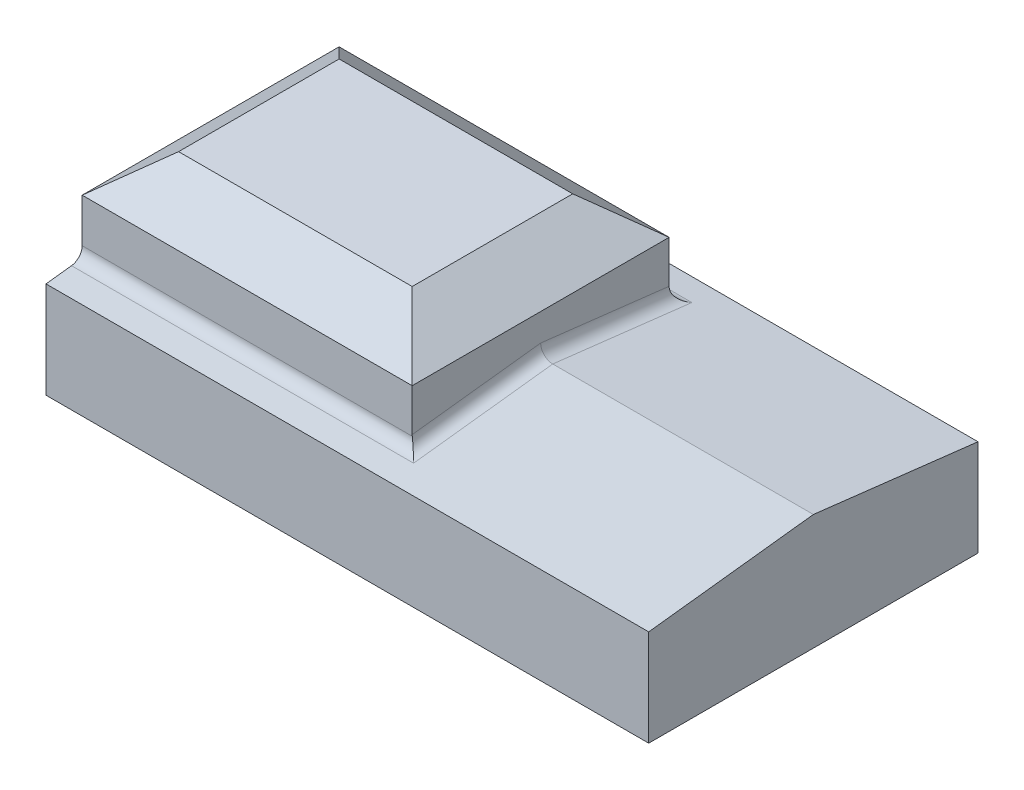
ISO-10303-21;
HEADER;
FILE_DESCRIPTION(('STEP AP214'),'2;1');
FILE_NAME('part.step','',(''),(''),'','','');
FILE_SCHEMA(('AUTOMOTIVE_DESIGN { 1 0 10303 214 1 1 1 1 }'));
ENDSEC;
DATA;
#1=APPLICATION_CONTEXT('core data for automotive mechanical design processes');
#2=APPLICATION_PROTOCOL_DEFINITION('international standard','automotive_design',2000,#1);
#3=PRODUCT_CONTEXT('',#1,'mechanical');
#4=PRODUCT('Part','Part','',(#3));
#5=PRODUCT_RELATED_PRODUCT_CATEGORY('part','',(#4));
#6=PRODUCT_DEFINITION_FORMATION('','',#4);
#7=PRODUCT_DEFINITION_CONTEXT('part definition',#1,'design');
#8=PRODUCT_DEFINITION('design','',#6,#7);
#9=PRODUCT_DEFINITION_SHAPE('','',#8);
#10=(LENGTH_UNIT() NAMED_UNIT(*) SI_UNIT(.MILLI.,.METRE.));
#11=(NAMED_UNIT(*) PLANE_ANGLE_UNIT() SI_UNIT($,.RADIAN.));
#12=(NAMED_UNIT(*) SI_UNIT($,.STERADIAN.) SOLID_ANGLE_UNIT());
#13=UNCERTAINTY_MEASURE_WITH_UNIT(LENGTH_MEASURE(1.E-05),#10,'distance_accuracy_value','');
#14=(GEOMETRIC_REPRESENTATION_CONTEXT(3) GLOBAL_UNCERTAINTY_ASSIGNED_CONTEXT((#13)) GLOBAL_UNIT_ASSIGNED_CONTEXT((#10,
#11,#12)) REPRESENTATION_CONTEXT('',''));
#15=CARTESIAN_POINT('',(0.,0.,0.));
#16=DIRECTION('',(0.,0.,1.));
#17=DIRECTION('',(1.,0.,0.));
#18=AXIS2_PLACEMENT_3D('',#15,#16,#17);
#19=CARTESIAN_POINT('',(32.5232512222331,4.49863587379356,-10.5540772411147));
#20=DIRECTION('',(0.,-0.993177047863036,0.116616257863411));
#21=DIRECTION('',(0.,-0.116616257863411,-0.993177047863036));
#22=AXIS2_PLACEMENT_3D('',#19,#20,#21);
#23=PLANE('',#22);
#24=DIRECTION('',(0.,0.116616257863411,0.993177047863036));
#25=VECTOR('',#24,1.);
#26=CARTESIAN_POINT('',(-6.11303627776691,4.49863587379356,-10.5540772411147));
#27=LINE('',#26,#25);
#28=CARTESIAN_POINT('',(-6.11303627776691,4.49863587379356,-10.5540772411147));
#29=VERTEX_POINT('',#28);
#30=CARTESIAN_POINT('',(-6.11303627776691,4.69067951819,-8.91851335579503));
#31=VERTEX_POINT('',#30);
#32=EDGE_CURVE('E252',#29,#31,#27,.T.);
#33=ORIENTED_EDGE('',*,*,#32,.T.);
#34=DIRECTION('',(-1.,0.,0.));
#35=VECTOR('',#34,1.);
#36=CARTESIAN_POINT('',(15.0428798323314,4.69067951819,-8.91851335579503));
#37=LINE('',#36,#35);
#38=CARTESIAN_POINT('',(15.8156055823314,4.69067951819,-8.91851335579503));
#39=VERTEX_POINT('',#38);
#40=EDGE_CURVE('E174',#31,#39,#37,.F.);
#41=ORIENTED_EDGE('',*,*,#40,.T.);
#42=DIRECTION('',(0.,-0.116616257863411,-0.993177047863036));
#43=VECTOR('',#42,1.);
#44=CARTESIAN_POINT('',(15.8156055823314,5.73786806756416,-1.82086710564559E-07));
#45=LINE('',#44,#43);
#46=CARTESIAN_POINT('',(15.8156055823314,5.73786806756416,-1.82086709433541E-07));
#47=VERTEX_POINT('',#46);
#48=EDGE_CURVE('E164',#39,#47,#45,.F.);
#49=ORIENTED_EDGE('',*,*,#48,.T.);
#50=DIRECTION('',(-1.,0.,0.));
#51=VECTOR('',#50,1.);
#52=CARTESIAN_POINT('',(32.5232512222331,5.73786806756416,-1.82086709433541E-07));
#53=LINE('',#52,#51);
#54=CARTESIAN_POINT('',(32.5232512222331,5.73786806756416,-1.82086709433541E-07));
#55=VERTEX_POINT('',#54);
#56=EDGE_CURVE('E144',#55,#47,#53,.T.);
#57=ORIENTED_EDGE('',*,*,#56,.F.);
#58=DIRECTION('',(0.,0.116616257863411,0.993177047863036));
#59=VECTOR('',#58,1.);
#60=CARTESIAN_POINT('',(32.5232512222331,4.49863587379356,-10.5540772411147));
#61=LINE('',#60,#59);
#62=CARTESIAN_POINT('',(32.5232512222331,4.49863587379356,-10.5540772411147));
#63=VERTEX_POINT('',#62);
#64=EDGE_CURVE('E151',#63,#55,#61,.T.);
#65=ORIENTED_EDGE('',*,*,#64,.F.);
#66=DIRECTION('',(-1.,0.,0.));
#67=VECTOR('',#66,1.);
#68=CARTESIAN_POINT('',(32.5232512222331,4.49863587379356,-10.5540772411147));
#69=LINE('',#68,#67);
#70=EDGE_CURVE('E423',#63,#29,#69,.T.);
#71=ORIENTED_EDGE('',*,*,#70,.T.);
#72=EDGE_LOOP('',(#33,#41,#49,#57,#65,#71));
#73=FACE_BOUND('',#72,.T.);
#74=ADVANCED_FACE('F35',(#73),#23,.F.);
#75=CARTESIAN_POINT('',(32.5232512222331,5.73786806756416,-1.82086709433541E-07));
#76=DIRECTION('',(0.,-0.993177047863036,-0.116616257863411));
#77=DIRECTION('',(0.,0.116616257863411,-0.993177047863036));
#78=AXIS2_PLACEMENT_3D('',#75,#76,#77);
#79=PLANE('',#78);
#80=ORIENTED_EDGE('',*,*,#56,.T.);
#81=DIRECTION('',(0.,0.116616257863411,-0.993177047863036));
#82=VECTOR('',#81,1.);
#83=CARTESIAN_POINT('',(15.8156055823314,4.77083019860278,8.23589962694131));
#84=LINE('',#83,#82);
#85=CARTESIAN_POINT('',(15.8156055823314,4.69067951819,8.91851299162161));
#86=VERTEX_POINT('',#85);
#87=EDGE_CURVE('E183',#47,#86,#84,.F.);
#88=ORIENTED_EDGE('',*,*,#87,.T.);
#89=DIRECTION('',(1.,0.,0.));
#90=VECTOR('',#89,1.);
#91=CARTESIAN_POINT('',(-6.11303627776691,4.69067951819,8.91851299162161));
#92=LINE('',#91,#90);
#93=CARTESIAN_POINT('',(-6.11303627776691,4.69067951819,8.91851299162161));
#94=VERTEX_POINT('',#93);
#95=EDGE_CURVE('E181',#86,#94,#92,.F.);
#96=ORIENTED_EDGE('',*,*,#95,.T.);
#97=DIRECTION('',(0.,-0.116616257863411,0.993177047863036));
#98=VECTOR('',#97,1.);
#99=CARTESIAN_POINT('',(-6.11303627776691,5.73786806756416,-1.82086709433541E-07));
#100=LINE('',#99,#98);
#101=CARTESIAN_POINT('',(-6.11303627776691,4.49863587379356,10.5540768769413));
#102=VERTEX_POINT('',#101);
#103=EDGE_CURVE('E411',#94,#102,#100,.T.);
#104=ORIENTED_EDGE('',*,*,#103,.T.);
#105=DIRECTION('',(-1.,0.,0.));
#106=VECTOR('',#105,1.);
#107=CARTESIAN_POINT('',(32.5232512222331,4.49863587379356,10.5540768769413));
#108=LINE('',#107,#106);
#109=CARTESIAN_POINT('',(32.5232512222331,4.49863587379356,10.5540768769413));
#110=VERTEX_POINT('',#109);
#111=EDGE_CURVE('E147',#110,#102,#108,.T.);
#112=ORIENTED_EDGE('',*,*,#111,.F.);
#113=DIRECTION('',(0.,-0.116616257863411,0.993177047863036));
#114=VECTOR('',#113,1.);
#115=CARTESIAN_POINT('',(32.5232512222331,5.73786806756416,-1.82086709433541E-07));
#116=LINE('',#115,#114);
#117=EDGE_CURVE('E140',#55,#110,#116,.T.);
#118=ORIENTED_EDGE('',*,*,#117,.F.);
#119=EDGE_LOOP('',(#80,#88,#96,#104,#112,#118));
#120=FACE_BOUND('',#119,.T.);
#121=ADVANCED_FACE('F142',(#120),#79,.F.);
#122=CARTESIAN_POINT('',(32.5232512222331,-1.68317012620644,10.5540768769413));
#123=DIRECTION('',(0.,0.,-1.));
#124=DIRECTION('',(-1.,0.,0.));
#125=AXIS2_PLACEMENT_3D('',#122,#123,#124);
#126=PLANE('',#125);
#127=DIRECTION('',(0.,-1.,0.));
#128=VECTOR('',#127,1.);
#129=CARTESIAN_POINT('',(-6.11303627776691,-1.68317012620644,10.5540768769413));
#130=LINE('',#129,#128);
#131=CARTESIAN_POINT('',(-6.11303627776691,-1.68317012620644,10.5540768769413));
#132=VERTEX_POINT('',#131);
#133=EDGE_CURVE('E406',#102,#132,#130,.T.);
#134=ORIENTED_EDGE('',*,*,#133,.T.);
#135=DIRECTION('',(-1.,0.,0.));
#136=VECTOR('',#135,1.);
#137=CARTESIAN_POINT('',(32.5232512222331,-1.68317012620644,10.5540768769413));
#138=LINE('',#137,#136);
#139=CARTESIAN_POINT('',(32.5232512222331,-1.68317012620644,10.5540768769413));
#140=VERTEX_POINT('',#139);
#141=EDGE_CURVE('E169',#140,#132,#138,.T.);
#142=ORIENTED_EDGE('',*,*,#141,.F.);
#143=DIRECTION('',(0.,-1.,0.));
#144=VECTOR('',#143,1.);
#145=CARTESIAN_POINT('',(32.5232512222331,-1.68317012620644,10.5540768769413));
#146=LINE('',#145,#144);
#147=EDGE_CURVE('E150',#110,#140,#146,.T.);
#148=ORIENTED_EDGE('',*,*,#147,.F.);
#149=ORIENTED_EDGE('',*,*,#111,.T.);
#150=EDGE_LOOP('',(#134,#142,#148,#149));
#151=FACE_BOUND('',#150,.T.);
#152=ADVANCED_FACE('F276',(#151),#126,.F.);
#153=CARTESIAN_POINT('',(32.5232512222331,-1.68317012620644,-10.5540772411147));
#154=DIRECTION('',(0.,1.,0.));
#155=DIRECTION('',(0.,0.,1.));
#156=AXIS2_PLACEMENT_3D('',#153,#154,#155);
#157=PLANE('',#156);
#158=DIRECTION('',(0.,0.,-1.));
#159=VECTOR('',#158,1.);
#160=CARTESIAN_POINT('',(-6.11303627776691,-1.68317012620644,-10.5540772411147));
#161=LINE('',#160,#159);
#162=CARTESIAN_POINT('',(-6.11303627776691,-1.68317012620644,-10.5540772411147));
#163=VERTEX_POINT('',#162);
#164=EDGE_CURVE('E410',#132,#163,#161,.T.);
#165=ORIENTED_EDGE('',*,*,#164,.T.);
#166=DIRECTION('',(-1.,0.,0.));
#167=VECTOR('',#166,1.);
#168=CARTESIAN_POINT('',(32.5232512222331,-1.68317012620644,-10.5540772411147));
#169=LINE('',#168,#167);
#170=CARTESIAN_POINT('',(32.5232512222331,-1.68317012620644,-10.5540772411147));
#171=VERTEX_POINT('',#170);
#172=EDGE_CURVE('E416',#171,#163,#169,.T.);
#173=ORIENTED_EDGE('',*,*,#172,.F.);
#174=DIRECTION('',(0.,0.,-1.));
#175=VECTOR('',#174,1.);
#176=CARTESIAN_POINT('',(32.5232512222331,-1.68317012620644,-10.5540772411147));
#177=LINE('',#176,#175);
#178=EDGE_CURVE('E415',#140,#171,#177,.T.);
#179=ORIENTED_EDGE('',*,*,#178,.F.);
#180=ORIENTED_EDGE('',*,*,#141,.T.);
#181=EDGE_LOOP('',(#165,#173,#179,#180));
#182=FACE_BOUND('',#181,.T.);
#183=ADVANCED_FACE('F371',(#182),#157,.F.);
#184=CARTESIAN_POINT('',(32.5232512222331,-1.68317012620644,-10.5540772411147));
#185=DIRECTION('',(0.,0.,1.));
#186=DIRECTION('',(1.,0.,0.));
#187=AXIS2_PLACEMENT_3D('',#184,#185,#186);
#188=PLANE('',#187);
#189=DIRECTION('',(0.,1.,0.));
#190=VECTOR('',#189,1.);
#191=CARTESIAN_POINT('',(-6.11303627776691,-1.68317012620644,-10.5540772411147));
#192=LINE('',#191,#190);
#193=EDGE_CURVE('E160',#163,#29,#192,.T.);
#194=ORIENTED_EDGE('',*,*,#193,.T.);
#195=ORIENTED_EDGE('',*,*,#70,.F.);
#196=DIRECTION('',(0.,1.,0.));
#197=VECTOR('',#196,1.);
#198=CARTESIAN_POINT('',(32.5232512222331,-1.68317012620644,-10.5540772411147));
#199=LINE('',#198,#197);
#200=EDGE_CURVE('E156',#171,#63,#199,.T.);
#201=ORIENTED_EDGE('',*,*,#200,.F.);
#202=ORIENTED_EDGE('',*,*,#172,.T.);
#203=EDGE_LOOP('',(#194,#195,#201,#202));
#204=FACE_BOUND('',#203,.T.);
#205=ADVANCED_FACE('F362',(#204),#188,.F.);
#206=CARTESIAN_POINT('',(32.5232512222331,-1.68317012620644,-1.82086709433541E-07));
#207=DIRECTION('',(-1.,0.,0.));
#208=DIRECTION('',(0.,0.,1.));
#209=AXIS2_PLACEMENT_3D('',#206,#207,#208);
#210=PLANE('',#209);
#211=ORIENTED_EDGE('',*,*,#64,.T.);
#212=ORIENTED_EDGE('',*,*,#117,.T.);
#213=ORIENTED_EDGE('',*,*,#147,.T.);
#214=ORIENTED_EDGE('',*,*,#178,.T.);
#215=ORIENTED_EDGE('',*,*,#200,.T.);
#216=EDGE_LOOP('',(#211,#212,#213,#214,#215));
#217=FACE_BOUND('',#216,.T.);
#218=ADVANCED_FACE('F154',(#217),#210,.F.);
#219=CARTESIAN_POINT('',(-6.11303627776691,-1.68317012620644,-1.82086709433541E-07));
#220=DIRECTION('',(-1.,0.,0.));
#221=DIRECTION('',(0.,0.,1.));
#222=AXIS2_PLACEMENT_3D('',#219,#220,#221);
#223=PLANE('',#222);
#224=DIRECTION('',(0.,-1.,0.));
#225=VECTOR('',#224,1.);
#226=CARTESIAN_POINT('',(-6.1130362777669,10.6804418737936,8.23589962694131));
#227=LINE('',#226,#225);
#228=CARTESIAN_POINT('',(-6.1130362777669,8.26556378696706,8.23589962694131));
#229=VERTEX_POINT('',#228);
#230=CARTESIAN_POINT('',(-6.1130362777669,5.45813299738276,8.23589962694131));
#231=VERTEX_POINT('',#230);
#232=EDGE_CURVE('E244',#229,#231,#227,.T.);
#233=ORIENTED_EDGE('',*,*,#232,.F.);
#234=DIRECTION('',(0.,0.,-1.));
#235=VECTOR('',#234,1.);
#236=CARTESIAN_POINT('',(-6.11303627776691,8.26556378696706,-1.82086709433541E-07));
#237=LINE('',#236,#235);
#238=CARTESIAN_POINT('',(-6.11303627776691,8.26556378696706,-8.23589999111472));
#239=VERTEX_POINT('',#238);
#240=EDGE_CURVE('E217',#229,#239,#237,.T.);
#241=ORIENTED_EDGE('',*,*,#240,.T.);
#242=DIRECTION('',(0.,-1.,0.));
#243=VECTOR('',#242,1.);
#244=CARTESIAN_POINT('',(-6.11303627776691,10.6804418737936,-8.23589999111472));
#245=LINE('',#244,#243);
#246=CARTESIAN_POINT('',(-6.11303627776691,5.45813299738276,-8.23589999111472));
#247=VERTEX_POINT('',#246);
#248=EDGE_CURVE('E208',#239,#247,#245,.T.);
#249=ORIENTED_EDGE('',*,*,#248,.T.);
#250=CARTESIAN_POINT('',(-6.11303627776691,5.45813299738276,-9.00862574111473));
#251=DIRECTION('',(-1.,0.,0.));
#252=DIRECTION('',(0.,0.,1.));
#253=AXIS2_PLACEMENT_3D('',#250,#251,#252);
#254=CIRCLE('',#253,0.77272575);
#255=EDGE_CURVE('E187',#247,#31,#254,.F.);
#256=ORIENTED_EDGE('',*,*,#255,.T.);
#257=ORIENTED_EDGE('',*,*,#32,.F.);
#258=ORIENTED_EDGE('',*,*,#193,.F.);
#259=ORIENTED_EDGE('',*,*,#164,.F.);
#260=ORIENTED_EDGE('',*,*,#133,.F.);
#261=ORIENTED_EDGE('',*,*,#103,.F.);
#262=CARTESIAN_POINT('',(-6.11303627776691,5.45813299738276,9.00862537694131));
#263=DIRECTION('',(-1.,0.,0.));
#264=DIRECTION('',(0.,0.,1.));
#265=AXIS2_PLACEMENT_3D('',#262,#263,#264);
#266=CIRCLE('',#265,0.77272575);
#267=EDGE_CURVE('E195',#94,#231,#266,.F.);
#268=ORIENTED_EDGE('',*,*,#267,.T.);
#269=EDGE_LOOP('',(#233,#241,#249,#256,#257,#258,#259,#260,#261,#268));
#270=FACE_BOUND('',#269,.T.);
#271=ADVANCED_FACE('F248',(#270),#223,.T.);
#272=CARTESIAN_POINT('',(15.0428798323314,10.6804418737936,-8.23589999111472));
#273=DIRECTION('',(-1.,0.,0.));
#274=DIRECTION('',(0.,0.,1.));
#275=AXIS2_PLACEMENT_3D('',#272,#273,#274);
#276=PLANE('',#275);
#277=DIRECTION('',(0.,-1.,0.));
#278=VECTOR('',#277,1.);
#279=CARTESIAN_POINT('',(15.0428798323314,10.6804418737936,-8.23589999111472));
#280=LINE('',#279,#278);
#281=CARTESIAN_POINT('',(15.0428798323314,8.26556378696706,-8.23589999111472));
#282=VERTEX_POINT('',#281);
#283=CARTESIAN_POINT('',(15.0428798323314,5.54886443898583,-8.23589999111472));
#284=VERTEX_POINT('',#283);
#285=EDGE_CURVE('E436',#282,#284,#280,.T.);
#286=ORIENTED_EDGE('',*,*,#285,.F.);
#287=DIRECTION('',(0.,0.,1.));
#288=VECTOR('',#287,1.);
#289=CARTESIAN_POINT('',(15.0428798323314,8.26556378696706,8.23589962694131));
#290=LINE('',#289,#288);
#291=CARTESIAN_POINT('',(15.0428798323314,8.26556378696706,8.23589962694131));
#292=VERTEX_POINT('',#291);
#293=EDGE_CURVE('E44',#282,#292,#290,.T.);
#294=ORIENTED_EDGE('',*,*,#293,.T.);
#295=DIRECTION('',(0.,-1.,0.));
#296=VECTOR('',#295,1.);
#297=CARTESIAN_POINT('',(15.0428798323314,10.6804418737936,8.23589962694131));
#298=LINE('',#297,#296);
#299=CARTESIAN_POINT('',(15.0428798323314,5.54886443898583,8.23589962694131));
#300=VERTEX_POINT('',#299);
#301=EDGE_CURVE('E245',#292,#300,#298,.T.);
#302=ORIENTED_EDGE('',*,*,#301,.T.);
#303=DIRECTION('',(0.,0.116616257863411,-0.993177047863036));
#304=VECTOR('',#303,1.);
#305=CARTESIAN_POINT('',(15.0428798323314,6.50532154675691,0.0901122032329883));
#306=LINE('',#305,#304);
#307=CARTESIAN_POINT('',(15.0428798323314,6.51590230794722,-1.82086707276682E-07));
#308=VERTEX_POINT('',#307);
#309=EDGE_CURVE('E176',#300,#308,#306,.T.);
#310=ORIENTED_EDGE('',*,*,#309,.T.);
#311=DIRECTION('',(0.,-0.116616257863411,-0.993177047863036));
#312=VECTOR('',#311,1.);
#313=CARTESIAN_POINT('',(15.0428798323314,5.53828367779553,-8.32601237643442));
#314=LINE('',#313,#312);
#315=EDGE_CURVE('E178',#308,#284,#314,.T.);
#316=ORIENTED_EDGE('',*,*,#315,.T.);
#317=EDGE_LOOP('',(#286,#294,#302,#310,#316));
#318=FACE_BOUND('',#317,.T.);
#319=ADVANCED_FACE('F335',(#318),#276,.F.);
#320=CARTESIAN_POINT('',(-6.1130362777669,10.6804418737936,8.23589962694131));
#321=DIRECTION('',(0.,0.,-1.));
#322=DIRECTION('',(-1.,0.,0.));
#323=AXIS2_PLACEMENT_3D('',#320,#321,#322);
#324=PLANE('',#323);
#325=ORIENTED_EDGE('',*,*,#301,.F.);
#326=DIRECTION('',(-1.,0.,0.));
#327=VECTOR('',#326,1.);
#328=CARTESIAN_POINT('',(-6.1130362777669,8.26556378696706,8.23589962694131));
#329=LINE('',#328,#327);
#330=EDGE_CURVE('E11',#292,#229,#329,.T.);
#331=ORIENTED_EDGE('',*,*,#330,.T.);
#332=ORIENTED_EDGE('',*,*,#232,.T.);
#333=DIRECTION('',(1.,0.,0.));
#334=VECTOR('',#333,1.);
#335=CARTESIAN_POINT('',(15.0428798323314,5.45813299738276,8.23589962694131));
#336=LINE('',#335,#334);
#337=CARTESIAN_POINT('',(15.0481521031386,5.45813299738276,8.23589962694131));
#338=VERTEX_POINT('',#337);
#339=EDGE_CURVE('E185',#231,#338,#336,.T.);
#340=ORIENTED_EDGE('',*,*,#339,.T.);
#341=CARTESIAN_POINT('',(15.8156055823314,5.54886443898583,8.23589962694131));
#342=DIRECTION('',(0.,0.,-1.));
#343=DIRECTION('',(0.,-1.,0.));
#344=AXIS2_PLACEMENT_3D('',#341,#342,#343);
#345=ELLIPSE('',#344,0.778034240383053,0.77272575);
#346=EDGE_CURVE('E192',#338,#300,#345,.T.);
#347=ORIENTED_EDGE('',*,*,#346,.T.);
#348=EDGE_LOOP('',(#325,#331,#332,#340,#347));
#349=FACE_BOUND('',#348,.T.);
#350=ADVANCED_FACE('F243',(#349),#324,.F.);
#351=CARTESIAN_POINT('',(-6.11303627776691,10.6804418737936,-8.23589999111472));
#352=DIRECTION('',(0.,0.,1.));
#353=DIRECTION('',(1.,0.,0.));
#354=AXIS2_PLACEMENT_3D('',#351,#352,#353);
#355=PLANE('',#354);
#356=ORIENTED_EDGE('',*,*,#248,.F.);
#357=DIRECTION('',(1.,0.,0.));
#358=VECTOR('',#357,1.);
#359=CARTESIAN_POINT('',(15.0428798323314,8.26556378696706,-8.23589999111472));
#360=LINE('',#359,#358);
#361=EDGE_CURVE('E59',#239,#282,#360,.T.);
#362=ORIENTED_EDGE('',*,*,#361,.T.);
#363=ORIENTED_EDGE('',*,*,#285,.T.);
#364=CARTESIAN_POINT('',(15.8156055823314,5.54886443898583,-8.23589999111472));
#365=DIRECTION('',(0.,0.,1.));
#366=DIRECTION('',(0.,1.,0.));
#367=AXIS2_PLACEMENT_3D('',#364,#365,#366);
#368=ELLIPSE('',#367,0.778034240383053,0.77272575);
#369=CARTESIAN_POINT('',(15.0481521031386,5.45813299738276,-8.23589999111472));
#370=VERTEX_POINT('',#369);
#371=EDGE_CURVE('E189',#284,#370,#368,.T.);
#372=ORIENTED_EDGE('',*,*,#371,.T.);
#373=DIRECTION('',(-1.,0.,0.));
#374=VECTOR('',#373,1.);
#375=CARTESIAN_POINT('',(-6.11303627776691,5.45813299738276,-8.23589999111472));
#376=LINE('',#375,#374);
#377=EDGE_CURVE('E165',#370,#247,#376,.T.);
#378=ORIENTED_EDGE('',*,*,#377,.T.);
#379=EDGE_LOOP('',(#356,#362,#363,#372,#378));
#380=FACE_BOUND('',#379,.T.);
#381=ADVANCED_FACE('F261',(#380),#355,.F.);
#382=CARTESIAN_POINT('',(-6.11303627776691,10.6804418737936,-1.82086709433541E-07));
#383=DIRECTION('',(0.,1.,0.));
#384=DIRECTION('',(0.,0.,1.));
#385=AXIS2_PLACEMENT_3D('',#382,#383,#384);
#386=PLANE('',#385);
#387=DIRECTION('',(-1.,0.,0.));
#388=VECTOR('',#387,1.);
#389=CARTESIAN_POINT('',(-6.11303627776691,10.6804418737936,-5.14499699111471));
#390=LINE('',#389,#388);
#391=CARTESIAN_POINT('',(11.9519768323314,10.6804418737936,-5.14499699111471));
#392=VERTEX_POINT('',#391);
#393=CARTESIAN_POINT('',(-3.02213327776689,10.6804418737936,-5.14499699111471));
#394=VERTEX_POINT('',#393);
#395=EDGE_CURVE('E212',#392,#394,#390,.T.);
#396=ORIENTED_EDGE('',*,*,#395,.T.);
#397=DIRECTION('',(0.,0.,1.));
#398=VECTOR('',#397,1.);
#399=CARTESIAN_POINT('',(-3.02213327776689,10.6804418737936,-1.82086709433541E-07));
#400=LINE('',#399,#398);
#401=CARTESIAN_POINT('',(-3.02213327776689,10.6804418737936,5.14499662694129));
#402=VERTEX_POINT('',#401);
#403=EDGE_CURVE('E214',#394,#402,#400,.T.);
#404=ORIENTED_EDGE('',*,*,#403,.T.);
#405=DIRECTION('',(1.,0.,0.));
#406=VECTOR('',#405,1.);
#407=CARTESIAN_POINT('',(15.0428798323314,10.6804418737936,5.14499662694129));
#408=LINE('',#407,#406);
#409=CARTESIAN_POINT('',(11.9519768323314,10.6804418737936,5.14499662694129));
#410=VERTEX_POINT('',#409);
#411=EDGE_CURVE('E198',#402,#410,#408,.T.);
#412=ORIENTED_EDGE('',*,*,#411,.T.);
#413=DIRECTION('',(0.,0.,-1.));
#414=VECTOR('',#413,1.);
#415=CARTESIAN_POINT('',(11.9519768323314,10.6804418737936,-8.23589999111472));
#416=LINE('',#415,#414);
#417=EDGE_CURVE('E210',#410,#392,#416,.T.);
#418=ORIENTED_EDGE('',*,*,#417,.T.);
#419=EDGE_LOOP('',(#396,#404,#412,#418));
#420=FACE_BOUND('',#419,.T.);
#421=ADVANCED_FACE('F258',(#420),#386,.T.);
#422=CARTESIAN_POINT('',(-6.1130362777669,5.45813299738276,9.00862537694131));
#423=DIRECTION('',(-1.,0.,0.));
#424=DIRECTION('',(0.,0.,1.));
#425=AXIS2_PLACEMENT_3D('',#422,#423,#424);
#426=CYLINDRICAL_SURFACE('',#425,0.77272575);
#427=ORIENTED_EDGE('',*,*,#267,.F.);
#428=ORIENTED_EDGE('',*,*,#95,.F.);
#429=CARTESIAN_POINT('',(15.8156055823314,5.45813299738276,9.00862537694131));
#430=DIRECTION('',(-0.707106781186547,-0.0824601467318172,0.702282225462789));
#431=DIRECTION('',(-0.707106781186547,0.0824601467318172,-0.702282225462789));
#432=AXIS2_PLACEMENT_3D('',#429,#430,#431);
#433=ELLIPSE('',#432,1.09279923564492,0.77272575);
#434=EDGE_CURVE('E205',#338,#86,#433,.T.);
#435=ORIENTED_EDGE('',*,*,#434,.F.);
#436=ORIENTED_EDGE('',*,*,#339,.F.);
#437=EDGE_LOOP('',(#427,#428,#435,#436));
#438=FACE_BOUND('',#437,.T.);
#439=ADVANCED_FACE('F260',(#438),#426,.F.);
#440=CARTESIAN_POINT('',(15.8156055823314,7.52642412671995,-8.60623652646852));
#441=DIRECTION('',(0.,-0.116616257863411,0.993177047863036));
#442=DIRECTION('',(0.,-0.993177047863036,-0.116616257863411));
#443=AXIS2_PLACEMENT_3D('',#440,#441,#442);
#444=CYLINDRICAL_SURFACE('',#443,0.77272575);
#445=ORIENTED_EDGE('',*,*,#434,.T.);
#446=ORIENTED_EDGE('',*,*,#87,.F.);
#447=CARTESIAN_POINT('',(15.8156055823314,6.51590230794722,-1.82086706082377E-07));
#448=DIRECTION('',(0.,0.,1.));
#449=DIRECTION('',(0.,-1.,0.));
#450=AXIS2_PLACEMENT_3D('',#447,#448,#449);
#451=ELLIPSE('',#450,0.778034240383053,0.77272575);
#452=EDGE_CURVE('E202',#308,#47,#451,.T.);
#453=ORIENTED_EDGE('',*,*,#452,.F.);
#454=ORIENTED_EDGE('',*,*,#309,.F.);
#455=ORIENTED_EDGE('',*,*,#346,.F.);
#456=EDGE_LOOP('',(#445,#446,#453,#454,#455));
#457=FACE_BOUND('',#456,.T.);
#458=ADVANCED_FACE('F267',(#457),#444,.F.);
#459=CARTESIAN_POINT('',(15.8156055823314,5.61865056477448,-7.6415576613021));
#460=DIRECTION('',(0.,0.116616257863411,0.993177047863036));
#461=DIRECTION('',(0.,-0.993177047863036,0.116616257863411));
#462=AXIS2_PLACEMENT_3D('',#459,#460,#461);
#463=CYLINDRICAL_SURFACE('',#462,0.77272575);
#464=ORIENTED_EDGE('',*,*,#452,.T.);
#465=ORIENTED_EDGE('',*,*,#48,.F.);
#466=CARTESIAN_POINT('',(15.8156055823314,5.45813299738276,-9.00862574111473));
#467=DIRECTION('',(0.707106781186547,0.0824601467318172,0.702282225462789));
#468=DIRECTION('',(-0.707106781186547,0.0824601467318172,0.702282225462789));
#469=AXIS2_PLACEMENT_3D('',#466,#467,#468);
#470=ELLIPSE('',#469,1.09279923564492,0.77272575);
#471=EDGE_CURVE('E199',#370,#39,#470,.T.);
#472=ORIENTED_EDGE('',*,*,#471,.F.);
#473=ORIENTED_EDGE('',*,*,#371,.F.);
#474=ORIENTED_EDGE('',*,*,#315,.F.);
#475=EDGE_LOOP('',(#464,#465,#472,#473,#474));
#476=FACE_BOUND('',#475,.T.);
#477=ADVANCED_FACE('F283',(#476),#463,.F.);
#478=CARTESIAN_POINT('',(-6.11303627776691,5.45813299738276,-9.00862574111473));
#479=DIRECTION('',(1.,0.,0.));
#480=DIRECTION('',(0.,0.,-1.));
#481=AXIS2_PLACEMENT_3D('',#478,#479,#480);
#482=CYLINDRICAL_SURFACE('',#481,0.77272575);
#483=ORIENTED_EDGE('',*,*,#471,.T.);
#484=ORIENTED_EDGE('',*,*,#40,.F.);
#485=ORIENTED_EDGE('',*,*,#255,.F.);
#486=ORIENTED_EDGE('',*,*,#377,.F.);
#487=EDGE_LOOP('',(#483,#484,#485,#486));
#488=FACE_BOUND('',#487,.T.);
#489=ADVANCED_FACE('F280',(#488),#482,.F.);
#490=CARTESIAN_POINT('',(11.9519768323314,10.6804418737936,-1.82086709433541E-07));
#491=DIRECTION('',(0.615661475325657,0.788010753606723,0.));
#492=DIRECTION('',(0.,0.,1.));
#493=AXIS2_PLACEMENT_3D('',#490,#491,#492);
#494=PLANE('',#493);
#495=DIRECTION('',(-0.6189361771297,0.483565938916448,-0.6189361771297));
#496=VECTOR('',#495,1.);
#497=CARTESIAN_POINT('',(5.03159563617172,16.0872362323004,-1.77538456921834));
#498=LINE('',#497,#496);
#499=EDGE_CURVE('E225',#292,#410,#498,.T.);
#500=ORIENTED_EDGE('',*,*,#499,.F.);
#501=ORIENTED_EDGE('',*,*,#293,.F.);
#502=DIRECTION('',(-0.6189361771297,0.483565938916448,0.6189361771297));
#503=VECTOR('',#502,1.);
#504=CARTESIAN_POINT('',(9.98102120918844,12.2203211726377,-3.17404136797179));
#505=LINE('',#504,#503);
#506=EDGE_CURVE('E39',#392,#282,#505,.F.);
#507=ORIENTED_EDGE('',*,*,#506,.F.);
#508=ORIENTED_EDGE('',*,*,#417,.F.);
#509=EDGE_LOOP('',(#500,#501,#507,#508));
#510=FACE_BOUND('',#509,.T.);
#511=ADVANCED_FACE('F37',(#510),#494,.T.);
#512=CARTESIAN_POINT('',(-6.11303627776691,10.6804418737936,-5.14499699111471));
#513=DIRECTION('',(0.,0.788010753606723,-0.615661475325657));
#514=DIRECTION('',(1.,0.,0.));
#515=AXIS2_PLACEMENT_3D('',#512,#513,#514);
#516=PLANE('',#515);
#517=ORIENTED_EDGE('',*,*,#506,.T.);
#518=ORIENTED_EDGE('',*,*,#361,.F.);
#519=DIRECTION('',(-0.6189361771297,-0.483565938916448,-0.6189361771297));
#520=VECTOR('',#519,1.);
#521=CARTESIAN_POINT('',(-4.20620255410727,9.75534556740062,-6.32906626745509));
#522=LINE('',#521,#520);
#523=EDGE_CURVE('E224',#394,#239,#522,.T.);
#524=ORIENTED_EDGE('',*,*,#523,.F.);
#525=ORIENTED_EDGE('',*,*,#395,.F.);
#526=EDGE_LOOP('',(#517,#518,#524,#525));
#527=FACE_BOUND('',#526,.T.);
#528=ADVANCED_FACE('F235',(#527),#516,.T.);
#529=CARTESIAN_POINT('',(-6.11303627776691,10.6804418737936,5.14499662694129));
#530=DIRECTION('',(0.,0.788010753606723,0.615661475325657));
#531=DIRECTION('',(-1.,0.,0.));
#532=AXIS2_PLACEMENT_3D('',#529,#530,#531);
#533=PLANE('',#532);
#534=ORIENTED_EDGE('',*,*,#499,.T.);
#535=ORIENTED_EDGE('',*,*,#411,.F.);
#536=DIRECTION('',(0.6189361771297,0.483565938916448,-0.6189361771297));
#537=VECTOR('',#536,1.);
#538=CARTESIAN_POINT('',(-4.20620255410727,9.75534556740062,6.32906590328167));
#539=LINE('',#538,#537);
#540=EDGE_CURVE('E222',#229,#402,#539,.T.);
#541=ORIENTED_EDGE('',*,*,#540,.F.);
#542=ORIENTED_EDGE('',*,*,#330,.F.);
#543=EDGE_LOOP('',(#534,#535,#541,#542));
#544=FACE_BOUND('',#543,.T.);
#545=ADVANCED_FACE('F240',(#544),#533,.T.);
#546=CARTESIAN_POINT('',(-3.02213327776689,10.6804418737936,-1.82086709433541E-07));
#547=DIRECTION('',(0.615661475325657,-0.788010753606723,0.));
#548=DIRECTION('',(0.,0.,1.));
#549=AXIS2_PLACEMENT_3D('',#546,#547,#548);
#550=PLANE('',#549);
#551=ORIENTED_EDGE('',*,*,#523,.T.);
#552=ORIENTED_EDGE('',*,*,#240,.F.);
#553=ORIENTED_EDGE('',*,*,#540,.T.);
#554=ORIENTED_EDGE('',*,*,#403,.F.);
#555=EDGE_LOOP('',(#551,#552,#553,#554));
#556=FACE_BOUND('',#555,.T.);
#557=ADVANCED_FACE('F255',(#556),#550,.F.);
#558=CLOSED_SHELL('',(#74,#121,#152,#183,#205,#218,#271,#319,#350,#381,#421,#439,#458,#477,#489,
#511,#528,#545,#557));
#559=MANIFOLD_SOLID_BREP('B2',#558);
#560=ADVANCED_BREP_SHAPE_REPRESENTATION('',(#18,#559),#14);
#561=SHAPE_DEFINITION_REPRESENTATION(#9,#560);
ENDSEC;
END-ISO-10303-21;
